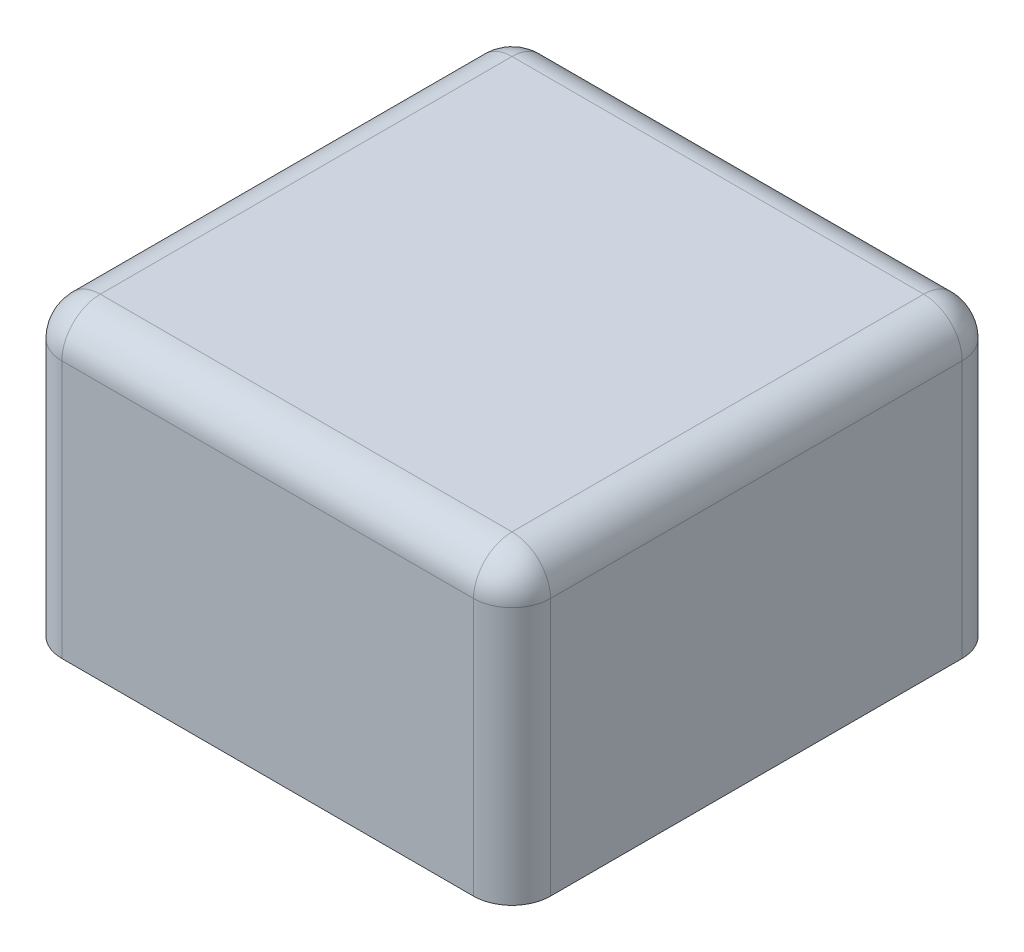
ISO-10303-21;
HEADER;
FILE_DESCRIPTION(('STEP AP214'),'2;1');
FILE_NAME('part.step','',(''),(''),'','','');
FILE_SCHEMA(('AUTOMOTIVE_DESIGN { 1 0 10303 214 1 1 1 1 }'));
ENDSEC;
DATA;
#1=APPLICATION_CONTEXT('core data for automotive mechanical design processes');
#2=APPLICATION_PROTOCOL_DEFINITION('international standard','automotive_design',2000,#1);
#3=PRODUCT_CONTEXT('',#1,'mechanical');
#4=PRODUCT('Part','Part','',(#3));
#5=PRODUCT_RELATED_PRODUCT_CATEGORY('part','',(#4));
#6=PRODUCT_DEFINITION_FORMATION('','',#4);
#7=PRODUCT_DEFINITION_CONTEXT('part definition',#1,'design');
#8=PRODUCT_DEFINITION('design','',#6,#7);
#9=PRODUCT_DEFINITION_SHAPE('','',#8);
#10=(LENGTH_UNIT() NAMED_UNIT(*) SI_UNIT(.MILLI.,.METRE.));
#11=(NAMED_UNIT(*) PLANE_ANGLE_UNIT() SI_UNIT($,.RADIAN.));
#12=(NAMED_UNIT(*) SI_UNIT($,.STERADIAN.) SOLID_ANGLE_UNIT());
#13=UNCERTAINTY_MEASURE_WITH_UNIT(LENGTH_MEASURE(1.E-05),#10,'distance_accuracy_value','');
#14=(GEOMETRIC_REPRESENTATION_CONTEXT(3) GLOBAL_UNCERTAINTY_ASSIGNED_CONTEXT((#13)) GLOBAL_UNIT_ASSIGNED_CONTEXT((#10,
#11,#12)) REPRESENTATION_CONTEXT('',''));
#15=CARTESIAN_POINT('',(0.,0.,0.));
#16=DIRECTION('',(0.,0.,1.));
#17=DIRECTION('',(1.,0.,0.));
#18=AXIS2_PLACEMENT_3D('',#15,#16,#17);
#19=CARTESIAN_POINT('',(12.7,15.4,12.7));
#20=DIRECTION('',(-1.,0.,0.));
#21=DIRECTION('',(0.,0.,1.));
#22=AXIS2_PLACEMENT_3D('',#19,#20,#21);
#23=PLANE('',#22);
#24=DIRECTION('',(0.,0.,-1.));
#25=VECTOR('',#24,1.);
#26=CARTESIAN_POINT('',(12.7,0.,12.7));
#27=LINE('',#26,#25);
#28=CARTESIAN_POINT('',(12.7,0.,10.7));
#29=VERTEX_POINT('',#28);
#30=CARTESIAN_POINT('',(12.7,0.,-10.7));
#31=VERTEX_POINT('',#30);
#32=EDGE_CURVE('E134',#29,#31,#27,.T.);
#33=ORIENTED_EDGE('',*,*,#32,.T.);
#34=DIRECTION('',(0.,-1.,0.));
#35=VECTOR('',#34,1.);
#36=CARTESIAN_POINT('',(12.7,15.4,-10.7));
#37=LINE('',#36,#35);
#38=CARTESIAN_POINT('',(12.7,13.4,-10.7));
#39=VERTEX_POINT('',#38);
#40=EDGE_CURVE('E112',#31,#39,#37,.F.);
#41=ORIENTED_EDGE('',*,*,#40,.T.);
#42=DIRECTION('',(0.,0.,-1.));
#43=VECTOR('',#42,1.);
#44=CARTESIAN_POINT('',(12.7,13.4,12.7));
#45=LINE('',#44,#43);
#46=CARTESIAN_POINT('',(12.7,13.4,10.7));
#47=VERTEX_POINT('',#46);
#48=EDGE_CURVE('E150',#39,#47,#45,.F.);
#49=ORIENTED_EDGE('',*,*,#48,.T.);
#50=DIRECTION('',(0.,-1.,0.));
#51=VECTOR('',#50,1.);
#52=CARTESIAN_POINT('',(12.7,15.4,10.7));
#53=LINE('',#52,#51);
#54=EDGE_CURVE('E117',#47,#29,#53,.T.);
#55=ORIENTED_EDGE('',*,*,#54,.T.);
#56=EDGE_LOOP('',(#33,#41,#49,#55));
#57=FACE_BOUND('',#56,.T.);
#58=ADVANCED_FACE('F32',(#57),#23,.F.);
#59=CARTESIAN_POINT('',(-12.7,15.4,-12.7));
#60=DIRECTION('',(0.,0.,1.));
#61=DIRECTION('',(1.,0.,0.));
#62=AXIS2_PLACEMENT_3D('',#59,#60,#61);
#63=PLANE('',#62);
#64=DIRECTION('',(-1.,0.,0.));
#65=VECTOR('',#64,1.);
#66=CARTESIAN_POINT('',(-12.7,13.4,-12.7));
#67=LINE('',#66,#65);
#68=CARTESIAN_POINT('',(-10.7,13.4,-12.7));
#69=VERTEX_POINT('',#68);
#70=CARTESIAN_POINT('',(10.7,13.4,-12.7));
#71=VERTEX_POINT('',#70);
#72=EDGE_CURVE('E126',#69,#71,#67,.F.);
#73=ORIENTED_EDGE('',*,*,#72,.T.);
#74=DIRECTION('',(0.,-1.,0.));
#75=VECTOR('',#74,1.);
#76=CARTESIAN_POINT('',(10.7,15.4,-12.7));
#77=LINE('',#76,#75);
#78=CARTESIAN_POINT('',(10.7,0.,-12.7));
#79=VERTEX_POINT('',#78);
#80=EDGE_CURVE('E111',#71,#79,#77,.T.);
#81=ORIENTED_EDGE('',*,*,#80,.T.);
#82=DIRECTION('',(-1.,0.,0.));
#83=VECTOR('',#82,1.);
#84=CARTESIAN_POINT('',(-12.7,0.,-12.7));
#85=LINE('',#84,#83);
#86=CARTESIAN_POINT('',(-10.7,0.,-12.7));
#87=VERTEX_POINT('',#86);
#88=EDGE_CURVE('E123',#79,#87,#85,.T.);
#89=ORIENTED_EDGE('',*,*,#88,.T.);
#90=DIRECTION('',(0.,-1.,0.));
#91=VECTOR('',#90,1.);
#92=CARTESIAN_POINT('',(-10.7,15.4,-12.7));
#93=LINE('',#92,#91);
#94=EDGE_CURVE('E142',#87,#69,#93,.F.);
#95=ORIENTED_EDGE('',*,*,#94,.T.);
#96=EDGE_LOOP('',(#73,#81,#89,#95));
#97=FACE_BOUND('',#96,.T.);
#98=ADVANCED_FACE('F122',(#97),#63,.F.);
#99=CARTESIAN_POINT('',(-12.7,15.4,12.7));
#100=DIRECTION('',(1.,0.,0.));
#101=DIRECTION('',(0.,0.,-1.));
#102=AXIS2_PLACEMENT_3D('',#99,#100,#101);
#103=PLANE('',#102);
#104=DIRECTION('',(0.,0.,1.));
#105=VECTOR('',#104,1.);
#106=CARTESIAN_POINT('',(-12.7,13.4,12.7));
#107=LINE('',#106,#105);
#108=CARTESIAN_POINT('',(-12.7,13.4,10.7));
#109=VERTEX_POINT('',#108);
#110=CARTESIAN_POINT('',(-12.7,13.4,-10.7));
#111=VERTEX_POINT('',#110);
#112=EDGE_CURVE('E162',#109,#111,#107,.F.);
#113=ORIENTED_EDGE('',*,*,#112,.T.);
#114=DIRECTION('',(0.,-1.,0.));
#115=VECTOR('',#114,1.);
#116=CARTESIAN_POINT('',(-12.7,15.4,-10.7));
#117=LINE('',#116,#115);
#118=CARTESIAN_POINT('',(-12.7,0.,-10.7));
#119=VERTEX_POINT('',#118);
#120=EDGE_CURVE('E166',#111,#119,#117,.T.);
#121=ORIENTED_EDGE('',*,*,#120,.T.);
#122=DIRECTION('',(0.,0.,1.));
#123=VECTOR('',#122,1.);
#124=CARTESIAN_POINT('',(-12.7,0.,12.7));
#125=LINE('',#124,#123);
#126=CARTESIAN_POINT('',(-12.7,0.,10.7));
#127=VERTEX_POINT('',#126);
#128=EDGE_CURVE('E133',#119,#127,#125,.T.);
#129=ORIENTED_EDGE('',*,*,#128,.T.);
#130=DIRECTION('',(0.,-1.,0.));
#131=VECTOR('',#130,1.);
#132=CARTESIAN_POINT('',(-12.7,15.4,10.7));
#133=LINE('',#132,#131);
#134=EDGE_CURVE('E164',#127,#109,#133,.F.);
#135=ORIENTED_EDGE('',*,*,#134,.T.);
#136=EDGE_LOOP('',(#113,#121,#129,#135));
#137=FACE_BOUND('',#136,.T.);
#138=ADVANCED_FACE('F234',(#137),#103,.F.);
#139=CARTESIAN_POINT('',(-12.7,15.4,12.7));
#140=DIRECTION('',(0.,0.,-1.));
#141=DIRECTION('',(-1.,0.,0.));
#142=AXIS2_PLACEMENT_3D('',#139,#140,#141);
#143=PLANE('',#142);
#144=DIRECTION('',(1.,0.,0.));
#145=VECTOR('',#144,1.);
#146=CARTESIAN_POINT('',(-12.7,0.,12.7));
#147=LINE('',#146,#145);
#148=CARTESIAN_POINT('',(-10.7,0.,12.7));
#149=VERTEX_POINT('',#148);
#150=CARTESIAN_POINT('',(10.7,0.,12.7));
#151=VERTEX_POINT('',#150);
#152=EDGE_CURVE('E137',#149,#151,#147,.T.);
#153=ORIENTED_EDGE('',*,*,#152,.T.);
#154=DIRECTION('',(0.,-1.,0.));
#155=VECTOR('',#154,1.);
#156=CARTESIAN_POINT('',(10.7,15.4,12.7));
#157=LINE('',#156,#155);
#158=CARTESIAN_POINT('',(10.7,13.4,12.7));
#159=VERTEX_POINT('',#158);
#160=EDGE_CURVE('E11',#151,#159,#157,.F.);
#161=ORIENTED_EDGE('',*,*,#160,.T.);
#162=DIRECTION('',(1.,0.,0.));
#163=VECTOR('',#162,1.);
#164=CARTESIAN_POINT('',(-12.7,13.4,12.7));
#165=LINE('',#164,#163);
#166=CARTESIAN_POINT('',(-10.7,13.4,12.7));
#167=VERTEX_POINT('',#166);
#168=EDGE_CURVE('E41',#159,#167,#165,.F.);
#169=ORIENTED_EDGE('',*,*,#168,.T.);
#170=DIRECTION('',(0.,-1.,0.));
#171=VECTOR('',#170,1.);
#172=CARTESIAN_POINT('',(-10.7,15.4,12.7));
#173=LINE('',#172,#171);
#174=EDGE_CURVE('E168',#167,#149,#173,.T.);
#175=ORIENTED_EDGE('',*,*,#174,.T.);
#176=EDGE_LOOP('',(#153,#161,#169,#175));
#177=FACE_BOUND('',#176,.T.);
#178=ADVANCED_FACE('F213',(#177),#143,.F.);
#179=CARTESIAN_POINT('',(0.,15.4,0.));
#180=DIRECTION('',(0.,-1.,0.));
#181=DIRECTION('',(0.,0.,-1.));
#182=AXIS2_PLACEMENT_3D('',#179,#180,#181);
#183=PLANE('',#182);
#184=DIRECTION('',(1.,0.,0.));
#185=VECTOR('',#184,1.);
#186=CARTESIAN_POINT('',(0.,15.4,10.7));
#187=LINE('',#186,#185);
#188=CARTESIAN_POINT('',(-10.7,15.4,10.7));
#189=VERTEX_POINT('',#188);
#190=CARTESIAN_POINT('',(10.7,15.4,10.7));
#191=VERTEX_POINT('',#190);
#192=EDGE_CURVE('E155',#189,#191,#187,.T.);
#193=ORIENTED_EDGE('',*,*,#192,.T.);
#194=DIRECTION('',(0.,0.,-1.));
#195=VECTOR('',#194,1.);
#196=CARTESIAN_POINT('',(10.7,15.4,0.));
#197=LINE('',#196,#195);
#198=CARTESIAN_POINT('',(10.7,15.4,-10.7));
#199=VERTEX_POINT('',#198);
#200=EDGE_CURVE('E159',#191,#199,#197,.T.);
#201=ORIENTED_EDGE('',*,*,#200,.T.);
#202=DIRECTION('',(-1.,0.,0.));
#203=VECTOR('',#202,1.);
#204=CARTESIAN_POINT('',(0.,15.4,-10.7));
#205=LINE('',#204,#203);
#206=CARTESIAN_POINT('',(-10.7,15.4,-10.7));
#207=VERTEX_POINT('',#206);
#208=EDGE_CURVE('E157',#199,#207,#205,.T.);
#209=ORIENTED_EDGE('',*,*,#208,.T.);
#210=DIRECTION('',(0.,0.,1.));
#211=VECTOR('',#210,1.);
#212=CARTESIAN_POINT('',(-10.7,15.4,0.));
#213=LINE('',#212,#211);
#214=EDGE_CURVE('E153',#207,#189,#213,.T.);
#215=ORIENTED_EDGE('',*,*,#214,.T.);
#216=EDGE_LOOP('',(#193,#201,#209,#215));
#217=FACE_BOUND('',#216,.T.);
#218=ADVANCED_FACE('F226',(#217),#183,.F.);
#219=CARTESIAN_POINT('',(0.,0.,0.));
#220=DIRECTION('',(0.,-1.,0.));
#221=DIRECTION('',(0.,0.,-1.));
#222=AXIS2_PLACEMENT_3D('',#219,#220,#221);
#223=PLANE('',#222);
#224=ORIENTED_EDGE('',*,*,#88,.F.);
#225=CARTESIAN_POINT('',(10.7,0.,-10.7));
#226=DIRECTION('',(0.,-1.,0.));
#227=DIRECTION('',(0.,0.,-1.));
#228=AXIS2_PLACEMENT_3D('',#225,#226,#227);
#229=CIRCLE('',#228,2.);
#230=EDGE_CURVE('E107',#79,#31,#229,.T.);
#231=ORIENTED_EDGE('',*,*,#230,.T.);
#232=ORIENTED_EDGE('',*,*,#32,.F.);
#233=CARTESIAN_POINT('',(10.7,0.,10.7));
#234=DIRECTION('',(0.,-1.,0.));
#235=DIRECTION('',(0.,0.,-1.));
#236=AXIS2_PLACEMENT_3D('',#233,#234,#235);
#237=CIRCLE('',#236,2.);
#238=EDGE_CURVE('E146',#29,#151,#237,.T.);
#239=ORIENTED_EDGE('',*,*,#238,.T.);
#240=ORIENTED_EDGE('',*,*,#152,.F.);
#241=CARTESIAN_POINT('',(-10.7,0.,10.7));
#242=DIRECTION('',(0.,-1.,0.));
#243=DIRECTION('',(0.,0.,-1.));
#244=AXIS2_PLACEMENT_3D('',#241,#242,#243);
#245=CIRCLE('',#244,2.);
#246=EDGE_CURVE('E128',#149,#127,#245,.T.);
#247=ORIENTED_EDGE('',*,*,#246,.T.);
#248=ORIENTED_EDGE('',*,*,#128,.F.);
#249=CARTESIAN_POINT('',(-10.7,0.,-10.7));
#250=DIRECTION('',(0.,-1.,0.));
#251=DIRECTION('',(0.,0.,-1.));
#252=AXIS2_PLACEMENT_3D('',#249,#250,#251);
#253=CIRCLE('',#252,2.);
#254=EDGE_CURVE('E118',#119,#87,#253,.T.);
#255=ORIENTED_EDGE('',*,*,#254,.T.);
#256=EDGE_LOOP('',(#224,#231,#232,#239,#240,#247,#248,#255));
#257=FACE_BOUND('',#256,.T.);
#258=ADVANCED_FACE('F130',(#257),#223,.T.);
#259=CARTESIAN_POINT('',(-10.7,15.4,10.7));
#260=DIRECTION('',(0.,-1.,0.));
#261=DIRECTION('',(0.,0.,-1.));
#262=AXIS2_PLACEMENT_3D('',#259,#260,#261);
#263=CYLINDRICAL_SURFACE('',#262,2.);
#264=CARTESIAN_POINT('',(-10.7,13.4,10.7));
#265=DIRECTION('',(0.,1.,0.));
#266=DIRECTION('',(0.,0.,1.));
#267=AXIS2_PLACEMENT_3D('',#264,#265,#266);
#268=CIRCLE('',#267,2.);
#269=EDGE_CURVE('E36',#109,#167,#268,.T.);
#270=ORIENTED_EDGE('',*,*,#269,.F.);
#271=ORIENTED_EDGE('',*,*,#134,.F.);
#272=ORIENTED_EDGE('',*,*,#246,.F.);
#273=ORIENTED_EDGE('',*,*,#174,.F.);
#274=EDGE_LOOP('',(#270,#271,#272,#273));
#275=FACE_BOUND('',#274,.T.);
#276=ADVANCED_FACE('F34',(#275),#263,.T.);
#277=CARTESIAN_POINT('',(-10.7,13.4,10.7));
#278=DIRECTION('',(0.,0.,1.));
#279=DIRECTION('',(1.,0.,0.));
#280=AXIS2_PLACEMENT_3D('',#277,#278,#279);
#281=SPHERICAL_SURFACE('',#280,2.);
#282=CARTESIAN_POINT('',(-10.7,13.4,10.7));
#283=DIRECTION('',(0.,0.,1.));
#284=DIRECTION('',(1.,0.,0.));
#285=AXIS2_PLACEMENT_3D('',#282,#283,#284);
#286=CIRCLE('',#285,2.);
#287=EDGE_CURVE('E196',#109,#189,#286,.F.);
#288=ORIENTED_EDGE('',*,*,#287,.F.);
#289=ORIENTED_EDGE('',*,*,#269,.T.);
#290=CARTESIAN_POINT('',(-10.7,13.4,10.7));
#291=DIRECTION('',(-1.,0.,0.));
#292=DIRECTION('',(0.,0.,1.));
#293=AXIS2_PLACEMENT_3D('',#290,#291,#292);
#294=CIRCLE('',#293,2.);
#295=EDGE_CURVE('E198',#189,#167,#294,.F.);
#296=ORIENTED_EDGE('',*,*,#295,.F.);
#297=EDGE_LOOP('',(#288,#289,#296));
#298=FACE_BOUND('',#297,.T.);
#299=ADVANCED_FACE('F207',(#298),#281,.T.);
#300=CARTESIAN_POINT('',(10.7,15.4,10.7));
#301=DIRECTION('',(0.,-1.,0.));
#302=DIRECTION('',(0.,0.,-1.));
#303=AXIS2_PLACEMENT_3D('',#300,#301,#302);
#304=CYLINDRICAL_SURFACE('',#303,2.);
#305=ORIENTED_EDGE('',*,*,#238,.F.);
#306=ORIENTED_EDGE('',*,*,#54,.F.);
#307=CARTESIAN_POINT('',(10.7,13.4,10.7));
#308=DIRECTION('',(0.,1.,0.));
#309=DIRECTION('',(0.,0.,1.));
#310=AXIS2_PLACEMENT_3D('',#307,#308,#309);
#311=CIRCLE('',#310,2.);
#312=EDGE_CURVE('E193',#159,#47,#311,.T.);
#313=ORIENTED_EDGE('',*,*,#312,.F.);
#314=ORIENTED_EDGE('',*,*,#160,.F.);
#315=EDGE_LOOP('',(#305,#306,#313,#314));
#316=FACE_BOUND('',#315,.T.);
#317=ADVANCED_FACE('F217',(#316),#304,.T.);
#318=CARTESIAN_POINT('',(0.,13.4,10.7));
#319=DIRECTION('',(1.,0.,0.));
#320=DIRECTION('',(0.,0.,-1.));
#321=AXIS2_PLACEMENT_3D('',#318,#319,#320);
#322=CYLINDRICAL_SURFACE('',#321,2.);
#323=ORIENTED_EDGE('',*,*,#295,.T.);
#324=ORIENTED_EDGE('',*,*,#168,.F.);
#325=CARTESIAN_POINT('',(10.7,13.4,10.7));
#326=DIRECTION('',(1.,0.,0.));
#327=DIRECTION('',(0.,0.,-1.));
#328=AXIS2_PLACEMENT_3D('',#325,#326,#327);
#329=CIRCLE('',#328,2.);
#330=EDGE_CURVE('E190',#191,#159,#329,.T.);
#331=ORIENTED_EDGE('',*,*,#330,.F.);
#332=ORIENTED_EDGE('',*,*,#192,.F.);
#333=EDGE_LOOP('',(#323,#324,#331,#332));
#334=FACE_BOUND('',#333,.T.);
#335=ADVANCED_FACE('F224',(#334),#322,.T.);
#336=CARTESIAN_POINT('',(-10.7,13.4,0.));
#337=DIRECTION('',(0.,0.,1.));
#338=DIRECTION('',(1.,0.,0.));
#339=AXIS2_PLACEMENT_3D('',#336,#337,#338);
#340=CYLINDRICAL_SURFACE('',#339,2.);
#341=ORIENTED_EDGE('',*,*,#287,.T.);
#342=ORIENTED_EDGE('',*,*,#214,.F.);
#343=CARTESIAN_POINT('',(-10.7,13.4,-10.7));
#344=DIRECTION('',(0.,0.,-1.));
#345=DIRECTION('',(0.,1.,0.));
#346=AXIS2_PLACEMENT_3D('',#343,#344,#345);
#347=CIRCLE('',#346,2.);
#348=EDGE_CURVE('E187',#111,#207,#347,.T.);
#349=ORIENTED_EDGE('',*,*,#348,.F.);
#350=ORIENTED_EDGE('',*,*,#112,.F.);
#351=EDGE_LOOP('',(#341,#342,#349,#350));
#352=FACE_BOUND('',#351,.T.);
#353=ADVANCED_FACE('F231',(#352),#340,.T.);
#354=CARTESIAN_POINT('',(-10.7,15.4,-10.7));
#355=DIRECTION('',(0.,-1.,0.));
#356=DIRECTION('',(0.,0.,-1.));
#357=AXIS2_PLACEMENT_3D('',#354,#355,#356);
#358=CYLINDRICAL_SURFACE('',#357,2.);
#359=ORIENTED_EDGE('',*,*,#254,.F.);
#360=ORIENTED_EDGE('',*,*,#120,.F.);
#361=CARTESIAN_POINT('',(-10.7,13.4,-10.7));
#362=DIRECTION('',(0.,1.,0.));
#363=DIRECTION('',(0.,0.,1.));
#364=AXIS2_PLACEMENT_3D('',#361,#362,#363);
#365=CIRCLE('',#364,2.);
#366=EDGE_CURVE('E184',#69,#111,#365,.T.);
#367=ORIENTED_EDGE('',*,*,#366,.F.);
#368=ORIENTED_EDGE('',*,*,#94,.F.);
#369=EDGE_LOOP('',(#359,#360,#367,#368));
#370=FACE_BOUND('',#369,.T.);
#371=ADVANCED_FACE('F237',(#370),#358,.T.);
#372=CARTESIAN_POINT('',(10.7,13.4,10.7));
#373=DIRECTION('',(0.,0.,1.));
#374=DIRECTION('',(1.,0.,0.));
#375=AXIS2_PLACEMENT_3D('',#372,#373,#374);
#376=SPHERICAL_SURFACE('',#375,2.);
#377=ORIENTED_EDGE('',*,*,#330,.T.);
#378=ORIENTED_EDGE('',*,*,#312,.T.);
#379=CARTESIAN_POINT('',(10.7,13.4,10.7));
#380=DIRECTION('',(0.,0.,1.));
#381=DIRECTION('',(1.,0.,0.));
#382=AXIS2_PLACEMENT_3D('',#379,#380,#381);
#383=CIRCLE('',#382,2.);
#384=EDGE_CURVE('E181',#191,#47,#383,.F.);
#385=ORIENTED_EDGE('',*,*,#384,.F.);
#386=EDGE_LOOP('',(#377,#378,#385));
#387=FACE_BOUND('',#386,.T.);
#388=ADVANCED_FACE('F222',(#387),#376,.T.);
#389=CARTESIAN_POINT('',(-10.7,13.4,-10.7));
#390=DIRECTION('',(0.,0.,1.));
#391=DIRECTION('',(1.,0.,0.));
#392=AXIS2_PLACEMENT_3D('',#389,#390,#391);
#393=SPHERICAL_SURFACE('',#392,2.);
#394=ORIENTED_EDGE('',*,*,#366,.T.);
#395=ORIENTED_EDGE('',*,*,#348,.T.);
#396=CARTESIAN_POINT('',(-10.7,13.4,-10.7));
#397=DIRECTION('',(-1.,0.,0.));
#398=DIRECTION('',(0.,0.,1.));
#399=AXIS2_PLACEMENT_3D('',#396,#397,#398);
#400=CIRCLE('',#399,2.);
#401=EDGE_CURVE('E178',#69,#207,#400,.F.);
#402=ORIENTED_EDGE('',*,*,#401,.F.);
#403=EDGE_LOOP('',(#394,#395,#402));
#404=FACE_BOUND('',#403,.T.);
#405=ADVANCED_FACE('F240',(#404),#393,.T.);
#406=CARTESIAN_POINT('',(10.7,13.4,0.));
#407=DIRECTION('',(0.,0.,-1.));
#408=DIRECTION('',(-1.,0.,0.));
#409=AXIS2_PLACEMENT_3D('',#406,#407,#408);
#410=CYLINDRICAL_SURFACE('',#409,2.);
#411=ORIENTED_EDGE('',*,*,#384,.T.);
#412=ORIENTED_EDGE('',*,*,#48,.F.);
#413=CARTESIAN_POINT('',(10.7,13.4,-10.7));
#414=DIRECTION('',(0.,0.,-1.));
#415=DIRECTION('',(-1.,0.,0.));
#416=AXIS2_PLACEMENT_3D('',#413,#414,#415);
#417=CIRCLE('',#416,2.);
#418=EDGE_CURVE('E175',#199,#39,#417,.T.);
#419=ORIENTED_EDGE('',*,*,#418,.F.);
#420=ORIENTED_EDGE('',*,*,#200,.F.);
#421=EDGE_LOOP('',(#411,#412,#419,#420));
#422=FACE_BOUND('',#421,.T.);
#423=ADVANCED_FACE('F249',(#422),#410,.T.);
#424=CARTESIAN_POINT('',(0.,13.4,-10.7));
#425=DIRECTION('',(-1.,0.,0.));
#426=DIRECTION('',(0.,0.,1.));
#427=AXIS2_PLACEMENT_3D('',#424,#425,#426);
#428=CYLINDRICAL_SURFACE('',#427,2.);
#429=ORIENTED_EDGE('',*,*,#401,.T.);
#430=ORIENTED_EDGE('',*,*,#208,.F.);
#431=CARTESIAN_POINT('',(10.7,13.4,-10.7));
#432=DIRECTION('',(1.,0.,0.));
#433=DIRECTION('',(0.,1.,0.));
#434=AXIS2_PLACEMENT_3D('',#431,#432,#433);
#435=CIRCLE('',#434,2.);
#436=EDGE_CURVE('E173',#71,#199,#435,.T.);
#437=ORIENTED_EDGE('',*,*,#436,.F.);
#438=ORIENTED_EDGE('',*,*,#72,.F.);
#439=EDGE_LOOP('',(#429,#430,#437,#438));
#440=FACE_BOUND('',#439,.T.);
#441=ADVANCED_FACE('F242',(#440),#428,.T.);
#442=CARTESIAN_POINT('',(10.7,13.4,-10.7));
#443=DIRECTION('',(0.,0.,1.));
#444=DIRECTION('',(1.,0.,0.));
#445=AXIS2_PLACEMENT_3D('',#442,#443,#444);
#446=SPHERICAL_SURFACE('',#445,2.);
#447=ORIENTED_EDGE('',*,*,#436,.T.);
#448=ORIENTED_EDGE('',*,*,#418,.T.);
#449=CARTESIAN_POINT('',(10.7,13.4,-10.7));
#450=DIRECTION('',(0.,1.,0.));
#451=DIRECTION('',(0.,0.,1.));
#452=AXIS2_PLACEMENT_3D('',#449,#450,#451);
#453=CIRCLE('',#452,2.);
#454=EDGE_CURVE('E171',#71,#39,#453,.F.);
#455=ORIENTED_EDGE('',*,*,#454,.F.);
#456=EDGE_LOOP('',(#447,#448,#455));
#457=FACE_BOUND('',#456,.T.);
#458=ADVANCED_FACE('F246',(#457),#446,.T.);
#459=CARTESIAN_POINT('',(10.7,15.4,-10.7));
#460=DIRECTION('',(0.,-1.,0.));
#461=DIRECTION('',(0.,0.,-1.));
#462=AXIS2_PLACEMENT_3D('',#459,#460,#461);
#463=CYLINDRICAL_SURFACE('',#462,2.);
#464=ORIENTED_EDGE('',*,*,#454,.T.);
#465=ORIENTED_EDGE('',*,*,#40,.F.);
#466=ORIENTED_EDGE('',*,*,#230,.F.);
#467=ORIENTED_EDGE('',*,*,#80,.F.);
#468=EDGE_LOOP('',(#464,#465,#466,#467));
#469=FACE_BOUND('',#468,.T.);
#470=ADVANCED_FACE('F110',(#469),#463,.T.);
#471=CLOSED_SHELL('',(#58,#98,#138,#178,#218,#258,#276,#299,#317,#335,#353,#371,#388,#405,#423,
#441,#458,#470));
#472=MANIFOLD_SOLID_BREP('B2',#471);
#473=ADVANCED_BREP_SHAPE_REPRESENTATION('',(#18,#472),#14);
#474=SHAPE_DEFINITION_REPRESENTATION(#9,#473);
ENDSEC;
END-ISO-10303-21;
